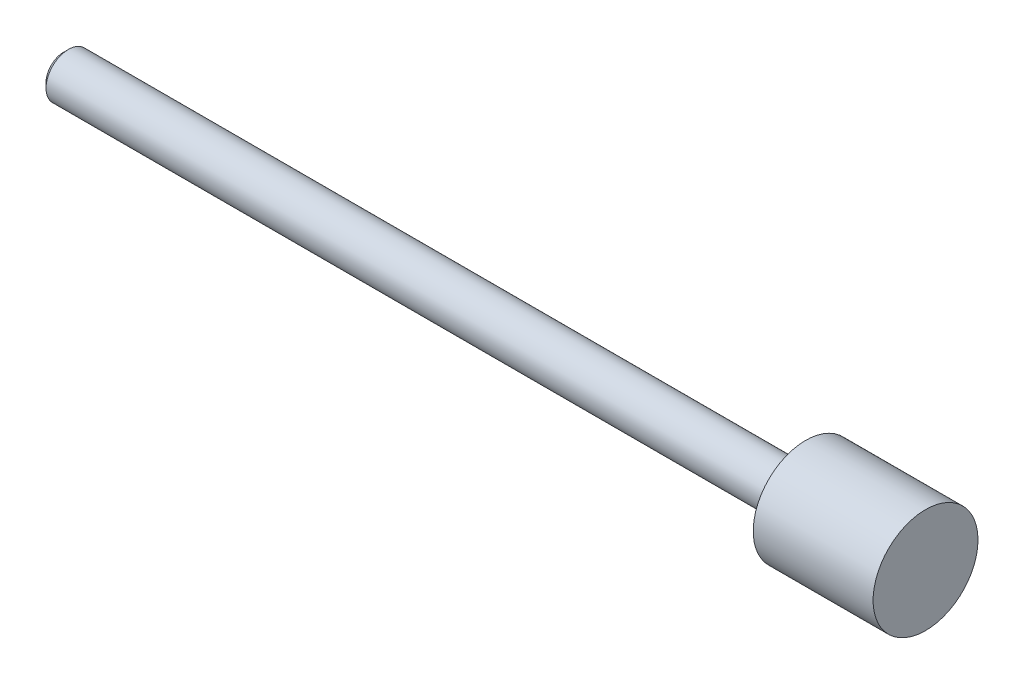
ISO-10303-21;
HEADER;
FILE_DESCRIPTION(('STEP AP214'),'2;1');
FILE_NAME('part.step','',(''),(''),'','','');
FILE_SCHEMA(('AUTOMOTIVE_DESIGN { 1 0 10303 214 1 1 1 1 }'));
ENDSEC;
DATA;
#1=APPLICATION_CONTEXT('core data for automotive mechanical design processes');
#2=APPLICATION_PROTOCOL_DEFINITION('international standard','automotive_design',2000,#1);
#3=PRODUCT_CONTEXT('',#1,'mechanical');
#4=PRODUCT('Part','Part','',(#3));
#5=PRODUCT_RELATED_PRODUCT_CATEGORY('part','',(#4));
#6=PRODUCT_DEFINITION_FORMATION('','',#4);
#7=PRODUCT_DEFINITION_CONTEXT('part definition',#1,'design');
#8=PRODUCT_DEFINITION('design','',#6,#7);
#9=PRODUCT_DEFINITION_SHAPE('','',#8);
#10=(LENGTH_UNIT() NAMED_UNIT(*) SI_UNIT(.MILLI.,.METRE.));
#11=(NAMED_UNIT(*) PLANE_ANGLE_UNIT() SI_UNIT($,.RADIAN.));
#12=(NAMED_UNIT(*) SI_UNIT($,.STERADIAN.) SOLID_ANGLE_UNIT());
#13=UNCERTAINTY_MEASURE_WITH_UNIT(LENGTH_MEASURE(1.E-05),#10,'distance_accuracy_value','');
#14=(GEOMETRIC_REPRESENTATION_CONTEXT(3) GLOBAL_UNCERTAINTY_ASSIGNED_CONTEXT((#13)) GLOBAL_UNIT_ASSIGNED_CONTEXT((#10,
#11,#12)) REPRESENTATION_CONTEXT('',''));
#15=CARTESIAN_POINT('',(0.,0.,0.));
#16=DIRECTION('',(0.,0.,1.));
#17=DIRECTION('',(1.,0.,0.));
#18=AXIS2_PLACEMENT_3D('',#15,#16,#17);
#19=CARTESIAN_POINT('',(659.797061156794,0.,0.));
#20=DIRECTION('',(-1.,0.,0.));
#21=DIRECTION('',(0.,0.,1.));
#22=AXIS2_PLACEMENT_3D('',#19,#20,#21);
#23=PLANE('',#22);
#24=CARTESIAN_POINT('',(659.797061156794,0.,0.));
#25=DIRECTION('',(1.,0.,0.));
#26=DIRECTION('',(0.,0.,-1.));
#27=AXIS2_PLACEMENT_3D('',#24,#25,#26);
#28=CIRCLE('',#27,5.55625000000001);
#29=CARTESIAN_POINT('',(659.797061156794,0.,-5.55625000000001));
#30=VERTEX_POINT('',#29);
#31=EDGE_CURVE('E18',#30,#30,#28,.F.);
#32=ORIENTED_EDGE('',*,*,#31,.F.);
#33=EDGE_LOOP('',(#32));
#34=FACE_BOUND('',#33,.T.);
#35=ADVANCED_FACE('F15',(#34),#23,.F.);
#36=CARTESIAN_POINT('',(568.484061156793,0.,0.));
#37=DIRECTION('',(-1.,0.,0.));
#38=DIRECTION('',(0.,0.,1.));
#39=AXIS2_PLACEMENT_3D('',#36,#37,#38);
#40=PLANE('',#39);
#41=CARTESIAN_POINT('',(568.484061156767,0.,0.));
#42=DIRECTION('',(1.,0.,0.));
#43=DIRECTION('',(0.,0.,-1.));
#44=AXIS2_PLACEMENT_3D('',#41,#42,#43);
#45=CIRCLE('',#44,1.8668999999818);
#46=CARTESIAN_POINT('',(568.484061156767,0.,-1.8668999999818));
#47=VERTEX_POINT('',#46);
#48=EDGE_CURVE('E31',#47,#47,#45,.T.);
#49=ORIENTED_EDGE('',*,*,#48,.F.);
#50=EDGE_LOOP('',(#49));
#51=FACE_BOUND('',#50,.T.);
#52=ADVANCED_FACE('F42',(#51),#40,.T.);
#53=CARTESIAN_POINT('',(647.097061156794,0.,0.));
#54=DIRECTION('',(1.,0.,0.));
#55=DIRECTION('',(0.,0.,-1.));
#56=AXIS2_PLACEMENT_3D('',#53,#54,#55);
#57=CYLINDRICAL_SURFACE('',#56,5.55625000000001);
#58=ORIENTED_EDGE('',*,*,#31,.T.);
#59=EDGE_LOOP('',(#58));
#60=FACE_BOUND('',#59,.T.);
#61=CARTESIAN_POINT('',(647.097061156794,0.,0.));
#62=DIRECTION('',(1.,0.,0.));
#63=DIRECTION('',(0.,0.,-1.));
#64=AXIS2_PLACEMENT_3D('',#61,#62,#63);
#65=CIRCLE('',#64,5.55625000000001);
#66=CARTESIAN_POINT('',(647.097061156794,0.,-5.55625000000001));
#67=VERTEX_POINT('',#66);
#68=EDGE_CURVE('E27',#67,#67,#65,.F.);
#69=ORIENTED_EDGE('',*,*,#68,.F.);
#70=EDGE_LOOP('',(#69));
#71=FACE_BOUND('',#70,.T.);
#72=ADVANCED_FACE('F38',(#60,#71),#57,.T.);
#73=CARTESIAN_POINT('',(568.992061156848,0.,0.));
#74=DIRECTION('',(1.,0.,0.));
#75=DIRECTION('',(0.,0.,-1.));
#76=AXIS2_PLACEMENT_3D('',#73,#74,#75);
#77=CONICAL_SURFACE('',#76,2.37490000000662,0.7853981633415);
#78=CARTESIAN_POINT('',(568.992061156794,0.,0.));
#79=DIRECTION('',(1.,0.,0.));
#80=DIRECTION('',(0.,0.,-1.));
#81=AXIS2_PLACEMENT_3D('',#78,#79,#80);
#82=CIRCLE('',#81,2.3749);
#83=CARTESIAN_POINT('',(568.992061156794,0.,-2.3749));
#84=VERTEX_POINT('',#83);
#85=EDGE_CURVE('E22',#84,#84,#82,.T.);
#86=ORIENTED_EDGE('',*,*,#85,.F.);
#87=EDGE_LOOP('',(#86));
#88=FACE_BOUND('',#87,.T.);
#89=ORIENTED_EDGE('',*,*,#48,.T.);
#90=EDGE_LOOP('',(#89));
#91=FACE_BOUND('',#90,.T.);
#92=ADVANCED_FACE('F55',(#88,#91),#77,.T.);
#93=CARTESIAN_POINT('',(647.097061156794,0.,0.));
#94=DIRECTION('',(-1.,0.,0.));
#95=DIRECTION('',(0.,0.,1.));
#96=AXIS2_PLACEMENT_3D('',#93,#94,#95);
#97=PLANE('',#96);
#98=CARTESIAN_POINT('',(647.097061156794,0.,0.));
#99=DIRECTION('',(1.,0.,0.));
#100=DIRECTION('',(0.,0.,-1.));
#101=AXIS2_PLACEMENT_3D('',#98,#99,#100);
#102=CIRCLE('',#101,2.3749);
#103=CARTESIAN_POINT('',(647.097061156794,0.,-2.3749));
#104=VERTEX_POINT('',#103);
#105=EDGE_CURVE('E10',#104,#104,#102,.F.);
#106=ORIENTED_EDGE('',*,*,#105,.F.);
#107=EDGE_LOOP('',(#106));
#108=FACE_BOUND('',#107,.T.);
#109=ORIENTED_EDGE('',*,*,#68,.T.);
#110=EDGE_LOOP('',(#109));
#111=FACE_BOUND('',#110,.T.);
#112=ADVANCED_FACE('F50',(#108,#111),#97,.T.);
#113=CARTESIAN_POINT('',(561.766829578234,0.,0.));
#114=DIRECTION('',(1.,0.,0.));
#115=DIRECTION('',(0.,0.,-1.));
#116=AXIS2_PLACEMENT_3D('',#113,#114,#115);
#117=CYLINDRICAL_SURFACE('',#116,2.3749);
#118=ORIENTED_EDGE('',*,*,#105,.T.);
#119=EDGE_LOOP('',(#118));
#120=FACE_BOUND('',#119,.T.);
#121=ORIENTED_EDGE('',*,*,#85,.T.);
#122=EDGE_LOOP('',(#121));
#123=FACE_BOUND('',#122,.T.);
#124=ADVANCED_FACE('F48',(#120,#123),#117,.T.);
#125=CLOSED_SHELL('',(#35,#52,#72,#92,#112,#124));
#126=MANIFOLD_SOLID_BREP('B1',#125);
#127=ADVANCED_BREP_SHAPE_REPRESENTATION('',(#18,#126),#14);
#128=SHAPE_DEFINITION_REPRESENTATION(#9,#127);
ENDSEC;
END-ISO-10303-21;
